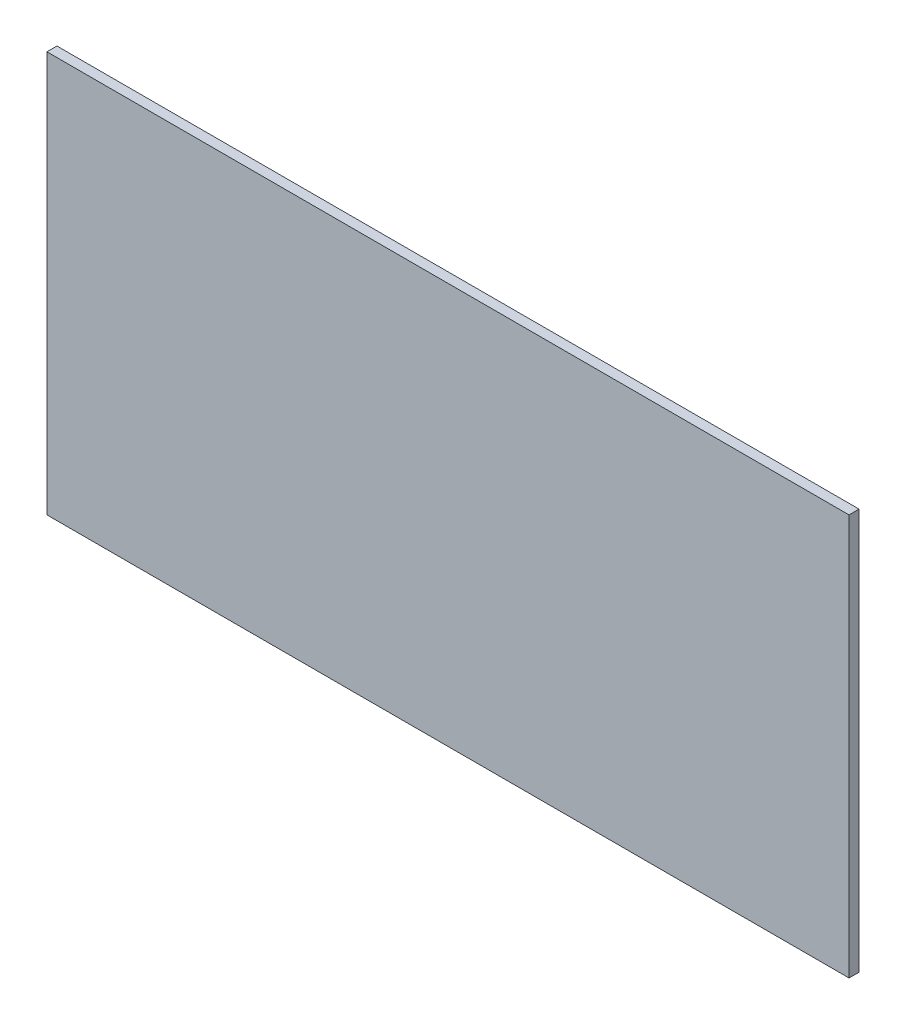
ISO-10303-21;
HEADER;
FILE_DESCRIPTION(('STEP AP214'),'2;1');
FILE_NAME('part.step','',(''),(''),'','','');
FILE_SCHEMA(('AUTOMOTIVE_DESIGN { 1 0 10303 214 1 1 1 1 }'));
ENDSEC;
DATA;
#1=APPLICATION_CONTEXT('core data for automotive mechanical design processes');
#2=APPLICATION_PROTOCOL_DEFINITION('international standard','automotive_design',2000,#1);
#3=PRODUCT_CONTEXT('',#1,'mechanical');
#4=PRODUCT('Part','Part','',(#3));
#5=PRODUCT_RELATED_PRODUCT_CATEGORY('part','',(#4));
#6=PRODUCT_DEFINITION_FORMATION('','',#4);
#7=PRODUCT_DEFINITION_CONTEXT('part definition',#1,'design');
#8=PRODUCT_DEFINITION('design','',#6,#7);
#9=PRODUCT_DEFINITION_SHAPE('','',#8);
#10=(LENGTH_UNIT() NAMED_UNIT(*) SI_UNIT(.MILLI.,.METRE.));
#11=(NAMED_UNIT(*) PLANE_ANGLE_UNIT() SI_UNIT($,.RADIAN.));
#12=(NAMED_UNIT(*) SI_UNIT($,.STERADIAN.) SOLID_ANGLE_UNIT());
#13=UNCERTAINTY_MEASURE_WITH_UNIT(LENGTH_MEASURE(1.E-05),#10,'distance_accuracy_value','');
#14=(GEOMETRIC_REPRESENTATION_CONTEXT(3) GLOBAL_UNCERTAINTY_ASSIGNED_CONTEXT((#13)) GLOBAL_UNIT_ASSIGNED_CONTEXT((#10,
#11,#12)) REPRESENTATION_CONTEXT('',''));
#15=CARTESIAN_POINT('',(0.,0.,0.));
#16=DIRECTION('',(0.,0.,1.));
#17=DIRECTION('',(1.,0.,0.));
#18=AXIS2_PLACEMENT_3D('',#15,#16,#17);
#19=CARTESIAN_POINT('',(127.,-63.5,1.5875));
#20=DIRECTION('',(-1.,0.,0.));
#21=DIRECTION('',(0.,0.,1.));
#22=AXIS2_PLACEMENT_3D('',#19,#20,#21);
#23=PLANE('',#22);
#24=DIRECTION('',(0.,1.,0.));
#25=VECTOR('',#24,1.);
#26=CARTESIAN_POINT('',(127.,-63.5,-1.5875));
#27=LINE('',#26,#25);
#28=CARTESIAN_POINT('',(127.,-63.5,-1.5875));
#29=VERTEX_POINT('',#28);
#30=CARTESIAN_POINT('',(127.,63.5,-1.5875));
#31=VERTEX_POINT('',#30);
#32=EDGE_CURVE('E107',#29,#31,#27,.T.);
#33=ORIENTED_EDGE('',*,*,#32,.T.);
#34=DIRECTION('',(0.,0.,-1.));
#35=VECTOR('',#34,1.);
#36=CARTESIAN_POINT('',(127.,63.5,1.5875));
#37=LINE('',#36,#35);
#38=CARTESIAN_POINT('',(127.,63.5,1.5875));
#39=VERTEX_POINT('',#38);
#40=EDGE_CURVE('E11',#39,#31,#37,.T.);
#41=ORIENTED_EDGE('',*,*,#40,.F.);
#42=DIRECTION('',(0.,1.,0.));
#43=VECTOR('',#42,1.);
#44=CARTESIAN_POINT('',(127.,-63.5,1.5875));
#45=LINE('',#44,#43);
#46=CARTESIAN_POINT('',(127.,-63.5,1.5875));
#47=VERTEX_POINT('',#46);
#48=EDGE_CURVE('E91',#47,#39,#45,.T.);
#49=ORIENTED_EDGE('',*,*,#48,.F.);
#50=DIRECTION('',(0.,0.,-1.));
#51=VECTOR('',#50,1.);
#52=CARTESIAN_POINT('',(127.,-63.5,1.5875));
#53=LINE('',#52,#51);
#54=EDGE_CURVE('E103',#47,#29,#53,.T.);
#55=ORIENTED_EDGE('',*,*,#54,.T.);
#56=EDGE_LOOP('',(#33,#41,#49,#55));
#57=FACE_BOUND('',#56,.T.);
#58=ADVANCED_FACE('F39',(#57),#23,.F.);
#59=CARTESIAN_POINT('',(-127.,63.5,1.5875));
#60=DIRECTION('',(0.,-1.,0.));
#61=DIRECTION('',(0.,0.,-1.));
#62=AXIS2_PLACEMENT_3D('',#59,#60,#61);
#63=PLANE('',#62);
#64=DIRECTION('',(-1.,0.,0.));
#65=VECTOR('',#64,1.);
#66=CARTESIAN_POINT('',(-127.,63.5,-1.5875));
#67=LINE('',#66,#65);
#68=CARTESIAN_POINT('',(-127.,63.5,-1.5875));
#69=VERTEX_POINT('',#68);
#70=EDGE_CURVE('E96',#31,#69,#67,.T.);
#71=ORIENTED_EDGE('',*,*,#70,.T.);
#72=DIRECTION('',(0.,0.,-1.));
#73=VECTOR('',#72,1.);
#74=CARTESIAN_POINT('',(-127.,63.5,1.5875));
#75=LINE('',#74,#73);
#76=CARTESIAN_POINT('',(-127.,63.5,1.5875));
#77=VERTEX_POINT('',#76);
#78=EDGE_CURVE('E48',#77,#69,#75,.T.);
#79=ORIENTED_EDGE('',*,*,#78,.F.);
#80=DIRECTION('',(-1.,0.,0.));
#81=VECTOR('',#80,1.);
#82=CARTESIAN_POINT('',(-127.,63.5,1.5875));
#83=LINE('',#82,#81);
#84=EDGE_CURVE('E86',#39,#77,#83,.T.);
#85=ORIENTED_EDGE('',*,*,#84,.F.);
#86=ORIENTED_EDGE('',*,*,#40,.T.);
#87=EDGE_LOOP('',(#71,#79,#85,#86));
#88=FACE_BOUND('',#87,.T.);
#89=ADVANCED_FACE('F95',(#88),#63,.F.);
#90=CARTESIAN_POINT('',(-127.,-63.5,1.5875));
#91=DIRECTION('',(1.,0.,0.));
#92=DIRECTION('',(0.,0.,-1.));
#93=AXIS2_PLACEMENT_3D('',#90,#91,#92);
#94=PLANE('',#93);
#95=DIRECTION('',(0.,-1.,0.));
#96=VECTOR('',#95,1.);
#97=CARTESIAN_POINT('',(-127.,-63.5,-1.5875));
#98=LINE('',#97,#96);
#99=CARTESIAN_POINT('',(-127.,-63.5,-1.5875));
#100=VERTEX_POINT('',#99);
#101=EDGE_CURVE('E73',#69,#100,#98,.T.);
#102=ORIENTED_EDGE('',*,*,#101,.T.);
#103=DIRECTION('',(0.,0.,-1.));
#104=VECTOR('',#103,1.);
#105=CARTESIAN_POINT('',(-127.,-63.5,1.5875));
#106=LINE('',#105,#104);
#107=CARTESIAN_POINT('',(-127.,-63.5,1.5875));
#108=VERTEX_POINT('',#107);
#109=EDGE_CURVE('E98',#108,#100,#106,.T.);
#110=ORIENTED_EDGE('',*,*,#109,.F.);
#111=DIRECTION('',(0.,-1.,0.));
#112=VECTOR('',#111,1.);
#113=CARTESIAN_POINT('',(-127.,-63.5,1.5875));
#114=LINE('',#113,#112);
#115=EDGE_CURVE('E89',#77,#108,#114,.T.);
#116=ORIENTED_EDGE('',*,*,#115,.F.);
#117=ORIENTED_EDGE('',*,*,#78,.T.);
#118=EDGE_LOOP('',(#102,#110,#116,#117));
#119=FACE_BOUND('',#118,.T.);
#120=ADVANCED_FACE('F99',(#119),#94,.F.);
#121=CARTESIAN_POINT('',(-127.,-63.5,1.5875));
#122=DIRECTION('',(0.,1.,0.));
#123=DIRECTION('',(0.,0.,1.));
#124=AXIS2_PLACEMENT_3D('',#121,#122,#123);
#125=PLANE('',#124);
#126=DIRECTION('',(1.,0.,0.));
#127=VECTOR('',#126,1.);
#128=CARTESIAN_POINT('',(-127.,-63.5,-1.5875));
#129=LINE('',#128,#127);
#130=EDGE_CURVE('E79',#100,#29,#129,.T.);
#131=ORIENTED_EDGE('',*,*,#130,.T.);
#132=ORIENTED_EDGE('',*,*,#54,.F.);
#133=DIRECTION('',(1.,0.,0.));
#134=VECTOR('',#133,1.);
#135=CARTESIAN_POINT('',(-127.,-63.5,1.5875));
#136=LINE('',#135,#134);
#137=EDGE_CURVE('E56',#108,#47,#136,.T.);
#138=ORIENTED_EDGE('',*,*,#137,.F.);
#139=ORIENTED_EDGE('',*,*,#109,.T.);
#140=EDGE_LOOP('',(#131,#132,#138,#139));
#141=FACE_BOUND('',#140,.T.);
#142=ADVANCED_FACE('F120',(#141),#125,.F.);
#143=CARTESIAN_POINT('',(0.,0.,1.5875));
#144=DIRECTION('',(0.,0.,-1.));
#145=DIRECTION('',(-1.,0.,0.));
#146=AXIS2_PLACEMENT_3D('',#143,#144,#145);
#147=PLANE('',#146);
#148=ORIENTED_EDGE('',*,*,#48,.T.);
#149=ORIENTED_EDGE('',*,*,#84,.T.);
#150=ORIENTED_EDGE('',*,*,#115,.T.);
#151=ORIENTED_EDGE('',*,*,#137,.T.);
#152=EDGE_LOOP('',(#148,#149,#150,#151));
#153=FACE_BOUND('',#152,.T.);
#154=ADVANCED_FACE('F87',(#153),#147,.F.);
#155=CARTESIAN_POINT('',(0.,0.,-1.5875));
#156=DIRECTION('',(0.,0.,-1.));
#157=DIRECTION('',(-1.,0.,0.));
#158=AXIS2_PLACEMENT_3D('',#155,#156,#157);
#159=PLANE('',#158);
#160=ORIENTED_EDGE('',*,*,#32,.F.);
#161=ORIENTED_EDGE('',*,*,#130,.F.);
#162=ORIENTED_EDGE('',*,*,#101,.F.);
#163=ORIENTED_EDGE('',*,*,#70,.F.);
#164=EDGE_LOOP('',(#160,#161,#162,#163));
#165=FACE_BOUND('',#164,.T.);
#166=ADVANCED_FACE('F123',(#165),#159,.T.);
#167=CLOSED_SHELL('',(#58,#89,#120,#142,#154,#166));
#168=MANIFOLD_SOLID_BREP('B2',#167);
#169=ADVANCED_BREP_SHAPE_REPRESENTATION('',(#18,#168),#14);
#170=SHAPE_DEFINITION_REPRESENTATION(#9,#169);
ENDSEC;
END-ISO-10303-21;
